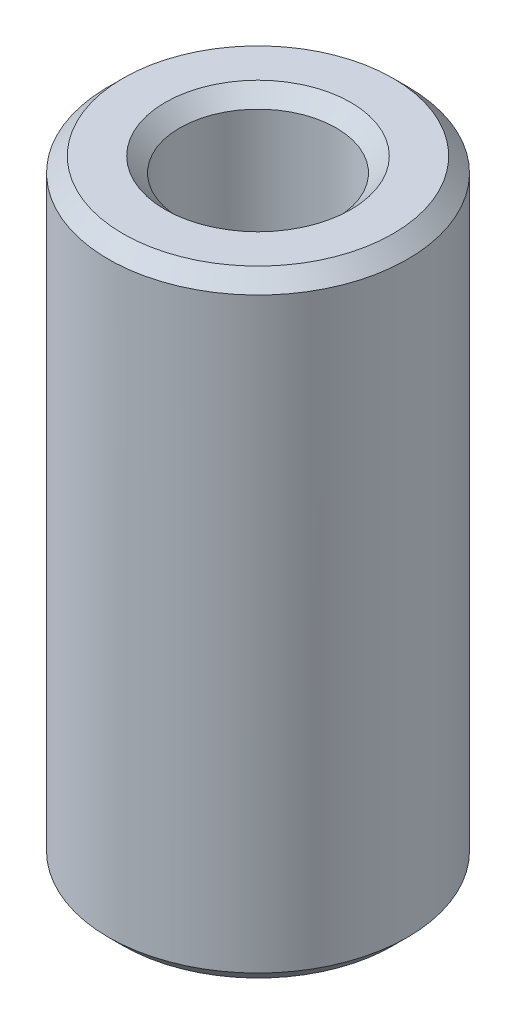
ISO-10303-21;
HEADER;
FILE_DESCRIPTION(('STEP AP214'),'2;1');
FILE_NAME('part.step','',(''),(''),'','','');
FILE_SCHEMA(('AUTOMOTIVE_DESIGN { 1 0 10303 214 1 1 1 1 }'));
ENDSEC;
DATA;
#1=APPLICATION_CONTEXT('core data for automotive mechanical design processes');
#2=APPLICATION_PROTOCOL_DEFINITION('international standard','automotive_design',2000,#1);
#3=PRODUCT_CONTEXT('',#1,'mechanical');
#4=PRODUCT('Part','Part','',(#3));
#5=PRODUCT_RELATED_PRODUCT_CATEGORY('part','',(#4));
#6=PRODUCT_DEFINITION_FORMATION('','',#4);
#7=PRODUCT_DEFINITION_CONTEXT('part definition',#1,'design');
#8=PRODUCT_DEFINITION('design','',#6,#7);
#9=PRODUCT_DEFINITION_SHAPE('','',#8);
#10=(LENGTH_UNIT() NAMED_UNIT(*) SI_UNIT(.MILLI.,.METRE.));
#11=(NAMED_UNIT(*) PLANE_ANGLE_UNIT() SI_UNIT($,.RADIAN.));
#12=(NAMED_UNIT(*) SI_UNIT($,.STERADIAN.) SOLID_ANGLE_UNIT());
#13=UNCERTAINTY_MEASURE_WITH_UNIT(LENGTH_MEASURE(1.E-05),#10,'distance_accuracy_value','');
#14=(GEOMETRIC_REPRESENTATION_CONTEXT(3) GLOBAL_UNCERTAINTY_ASSIGNED_CONTEXT((#13)) GLOBAL_UNIT_ASSIGNED_CONTEXT((#10,
#11,#12)) REPRESENTATION_CONTEXT('',''));
#15=CARTESIAN_POINT('',(0.,0.,0.));
#16=DIRECTION('',(0.,0.,1.));
#17=DIRECTION('',(1.,0.,0.));
#18=AXIS2_PLACEMENT_3D('',#15,#16,#17);
#19=CARTESIAN_POINT('',(0.,113.377159382142,0.));
#20=DIRECTION('',(0.,-1.,0.));
#21=DIRECTION('',(0.,0.,-1.));
#22=AXIS2_PLACEMENT_3D('',#19,#20,#21);
#23=CYLINDRICAL_SURFACE('',#22,27.5);
#24=CARTESIAN_POINT('',(0.,2.7012525845611,0.));
#25=DIRECTION('',(0.,1.,0.));
#26=DIRECTION('',(0.,0.,1.));
#27=AXIS2_PLACEMENT_3D('',#24,#25,#26);
#28=CIRCLE('',#27,27.5);
#29=CARTESIAN_POINT('',(0.,2.7012525845611,-27.5));
#30=VERTEX_POINT('',#29);
#31=EDGE_CURVE('E10',#30,#30,#28,.T.);
#32=CARTESIAN_POINT('',(0.,110.675906797581,0.));
#33=DIRECTION('',(0.,1.,0.));
#34=DIRECTION('',(0.,0.,1.));
#35=AXIS2_PLACEMENT_3D('',#32,#33,#34);
#36=CIRCLE('',#35,27.5);
#37=CARTESIAN_POINT('',(0.,110.675906797581,-27.5));
#38=VERTEX_POINT('',#37);
#39=EDGE_CURVE('E50',#38,#38,#36,.F.);
#40=CARTESIAN_POINT('',(0.,2.7012525845611,-27.5));
#41=CARTESIAN_POINT('',(0.,3.82598856594672,-27.5));
#42=CARTESIAN_POINT('',(0.,4.95072454733234,-27.5));
#43=CARTESIAN_POINT('',(0.,7.20019651010359,-27.5));
#44=CARTESIAN_POINT('',(0.,8.32493249148922,-27.5));
#45=CARTESIAN_POINT('',(0.,10.5744044542605,-27.5));
#46=CARTESIAN_POINT('',(0.,11.6991404356461,-27.5));
#47=CARTESIAN_POINT('',(0.,13.9486123984173,-27.5));
#48=CARTESIAN_POINT('',(0.,15.073348379803,-27.5));
#49=CARTESIAN_POINT('',(0.,17.3228203425742,-27.5));
#50=CARTESIAN_POINT('',(0.,18.4475563239598,-27.5));
#51=CARTESIAN_POINT('',(0.,20.6970282867311,-27.5));
#52=CARTESIAN_POINT('',(0.,21.8217642681167,-27.5));
#53=CARTESIAN_POINT('',(0.,24.071236230888,-27.5));
#54=CARTESIAN_POINT('',(0.,25.1959722122736,-27.5));
#55=CARTESIAN_POINT('',(0.,27.4454441750448,-27.5));
#56=CARTESIAN_POINT('',(0.,28.5701801564305,-27.5));
#57=CARTESIAN_POINT('',(0.,30.8196521192017,-27.5));
#58=CARTESIAN_POINT('',(0.,31.9443881005873,-27.5));
#59=CARTESIAN_POINT('',(0.,34.1938600633586,-27.5));
#60=CARTESIAN_POINT('',(0.,35.3185960447442,-27.5));
#61=CARTESIAN_POINT('',(0.,37.5680680075154,-27.5));
#62=CARTESIAN_POINT('',(0.,38.6928039889011,-27.5));
#63=CARTESIAN_POINT('',(0.,40.9422759516723,-27.5));
#64=CARTESIAN_POINT('',(0.,42.0670119330579,-27.5));
#65=CARTESIAN_POINT('',(0.,44.3164838958292,-27.5));
#66=CARTESIAN_POINT('',(0.,45.4412198772148,-27.5));
#67=CARTESIAN_POINT('',(0.,47.6906918399861,-27.5));
#68=CARTESIAN_POINT('',(0.,48.8154278213717,-27.5));
#69=CARTESIAN_POINT('',(0.,51.0648997841429,-27.5));
#70=CARTESIAN_POINT('',(0.,52.1896357655286,-27.5));
#71=CARTESIAN_POINT('',(0.,54.4391077282998,-27.5));
#72=CARTESIAN_POINT('',(0.,55.5638437096854,-27.5));
#73=CARTESIAN_POINT('',(0.,57.8133156724567,-27.5));
#74=CARTESIAN_POINT('',(0.,58.9380516538423,-27.5));
#75=CARTESIAN_POINT('',(0.,61.1875236166136,-27.5));
#76=CARTESIAN_POINT('',(0.,62.3122595979992,-27.5));
#77=CARTESIAN_POINT('',(0.,64.5617315607704,-27.5));
#78=CARTESIAN_POINT('',(0.,65.6864675421561,-27.5));
#79=CARTESIAN_POINT('',(0.,67.9359395049273,-27.5));
#80=CARTESIAN_POINT('',(0.,69.0606754863129,-27.5));
#81=CARTESIAN_POINT('',(0.,71.3101474490842,-27.5));
#82=CARTESIAN_POINT('',(0.,72.4348834304698,-27.5));
#83=CARTESIAN_POINT('',(0.,74.684355393241,-27.5));
#84=CARTESIAN_POINT('',(0.,75.8090913746267,-27.5));
#85=CARTESIAN_POINT('',(0.,78.0585633373979,-27.5));
#86=CARTESIAN_POINT('',(0.,79.1832993187835,-27.5));
#87=CARTESIAN_POINT('',(0.,81.4327712815548,-27.5));
#88=CARTESIAN_POINT('',(0.,82.5575072629404,-27.5));
#89=CARTESIAN_POINT('',(0.,84.8069792257117,-27.5));
#90=CARTESIAN_POINT('',(0.,85.9317152070973,-27.5));
#91=CARTESIAN_POINT('',(0.,88.1811871698685,-27.5));
#92=CARTESIAN_POINT('',(0.,89.3059231512542,-27.5));
#93=CARTESIAN_POINT('',(0.,91.5553951140254,-27.5));
#94=CARTESIAN_POINT('',(0.,92.680131095411,-27.5));
#95=CARTESIAN_POINT('',(0.,94.9296030581823,-27.5));
#96=CARTESIAN_POINT('',(0.,96.0543390395679,-27.5));
#97=CARTESIAN_POINT('',(0.,98.3038110023391,-27.5));
#98=CARTESIAN_POINT('',(0.,99.4285469837248,-27.5));
#99=CARTESIAN_POINT('',(0.,101.678018946496,-27.5));
#100=CARTESIAN_POINT('',(0.,102.802754927882,-27.5));
#101=CARTESIAN_POINT('',(0.,105.052226890653,-27.5));
#102=CARTESIAN_POINT('',(0.,106.176962872039,-27.5));
#103=CARTESIAN_POINT('',(0.,108.42643483481,-27.5));
#104=CARTESIAN_POINT('',(0.,109.551170816195,-27.5));
#105=CARTESIAN_POINT('',(0.,110.675906797581,-27.5));
#106=B_SPLINE_CURVE_WITH_KNOTS('',3,(#40,#41,#42,#43,#44,#45,#46,#47,#48,#49,#50,#51,#52,#53,
#54,#55,#56,#57,#58,#59,#60,#61,#62,#63,#64,#65,#66,#67,#68,#69,#70,#71,#72,#73,#74,#75,#76,#77,
#78,#79,#80,#81,#82,#83,#84,#85,#86,#87,#88,#89,#90,#91,#92,#93,#94,#95,#96,#97,#98,#99,#100,
#101,#102,#103,#104,#105),.UNSPECIFIED.,.F.,.F.,(4,2,2,2,2,2,2,2,2,2,2,2,2,2,2,2,2,2,2,2,2,2,2,
2,2,2,2,2,2,2,2,2,4),(0.,3.37420794415687,6.74841588831375,10.1226238324706,13.4968317766275,
16.8710397207844,20.2452476649412,23.6194556090981,26.993663553255,30.3678714974119,
33.7420794415687,37.1162873857256,40.4904953298825,43.8647032740393,47.2389112181962,
50.6131191623531,53.98732710651,57.3615350506668,60.7357429948237,64.1099509389806,
67.4841588831375,70.8583668272943,74.2325747714512,77.6067827156081,80.9809906597649,
84.3551986039218,87.7294065480787,91.1036144922356,94.4778224363924,97.8520303805493,
101.226238324706,104.600446268863,107.97465421302),.UNSPECIFIED.);
#107=EDGE_CURVE('BSEAM39',#30,#38,#106,.T.);
#108=ORIENTED_EDGE('',*,*,#31,.T.);
#109=ORIENTED_EDGE('',*,*,#39,.T.);
#110=ORIENTED_EDGE('',*,*,#107,.T.);
#111=ORIENTED_EDGE('',*,*,#107,.F.);
#112=EDGE_LOOP('',(#108,#110,#109,#111));
#113=FACE_BOUND('',#112,.T.);
#114=ADVANCED_FACE('F39',(#113),#23,.T.);
#115=CARTESIAN_POINT('',(0.,113.377159382142,0.));
#116=DIRECTION('',(0.,1.,0.));
#117=DIRECTION('',(0.,0.,1.));
#118=AXIS2_PLACEMENT_3D('',#115,#116,#117);
#119=PLANE('',#118);
#120=CARTESIAN_POINT('',(0.,113.377159382142,0.));
#121=DIRECTION('',(0.,1.,0.));
#122=DIRECTION('',(0.,0.,1.));
#123=AXIS2_PLACEMENT_3D('',#120,#121,#122);
#124=CIRCLE('',#123,17.073561657783);
#125=CARTESIAN_POINT('',(0.,113.377159382142,17.073561657783));
#126=VERTEX_POINT('',#125);
#127=EDGE_CURVE('E58',#126,#126,#124,.F.);
#128=ORIENTED_EDGE('',*,*,#127,.T.);
#129=EDGE_LOOP('',(#128));
#130=FACE_BOUND('',#129,.T.);
#131=CARTESIAN_POINT('',(0.,113.377159382142,0.));
#132=DIRECTION('',(0.,1.,0.));
#133=DIRECTION('',(0.,0.,1.));
#134=AXIS2_PLACEMENT_3D('',#131,#132,#133);
#135=CIRCLE('',#134,24.7987474154391);
#136=CARTESIAN_POINT('',(0.,113.377159382142,24.7987474154391));
#137=VERTEX_POINT('',#136);
#138=EDGE_CURVE('E61',#137,#137,#135,.T.);
#139=ORIENTED_EDGE('',*,*,#138,.T.);
#140=EDGE_LOOP('',(#139));
#141=FACE_BOUND('',#140,.T.);
#142=ADVANCED_FACE('F88',(#130,#141),#119,.T.);
#143=CARTESIAN_POINT('',(0.,0.,0.));
#144=DIRECTION('',(0.,1.,0.));
#145=DIRECTION('',(0.,0.,1.));
#146=AXIS2_PLACEMENT_3D('',#143,#144,#145);
#147=PLANE('',#146);
#148=CARTESIAN_POINT('',(0.,0.,0.));
#149=DIRECTION('',(0.,1.,0.));
#150=DIRECTION('',(0.,0.,1.));
#151=AXIS2_PLACEMENT_3D('',#148,#149,#150);
#152=CIRCLE('',#151,17.0735616577828);
#153=CARTESIAN_POINT('',(0.,0.,17.0735616577828));
#154=VERTEX_POINT('',#153);
#155=EDGE_CURVE('E51',#154,#154,#152,.T.);
#156=ORIENTED_EDGE('',*,*,#155,.T.);
#157=EDGE_LOOP('',(#156));
#158=FACE_BOUND('',#157,.T.);
#159=CARTESIAN_POINT('',(0.,0.,0.));
#160=DIRECTION('',(0.,1.,0.));
#161=DIRECTION('',(0.,0.,1.));
#162=AXIS2_PLACEMENT_3D('',#159,#160,#161);
#163=CIRCLE('',#162,24.7987474154389);
#164=CARTESIAN_POINT('',(0.,0.,24.7987474154389));
#165=VERTEX_POINT('',#164);
#166=EDGE_CURVE('E54',#165,#165,#163,.F.);
#167=ORIENTED_EDGE('',*,*,#166,.T.);
#168=EDGE_LOOP('',(#167));
#169=FACE_BOUND('',#168,.T.);
#170=ADVANCED_FACE('F83',(#158,#169),#147,.F.);
#171=CARTESIAN_POINT('',(0.,113.377159382142,0.));
#172=DIRECTION('',(0.,-1.,0.));
#173=DIRECTION('',(0.,0.,-1.));
#174=AXIS2_PLACEMENT_3D('',#171,#172,#173);
#175=CYLINDRICAL_SURFACE('',#174,14.3723090732219);
#176=CARTESIAN_POINT('',(0.,110.675906797581,0.));
#177=DIRECTION('',(0.,1.,0.));
#178=DIRECTION('',(0.,0.,1.));
#179=AXIS2_PLACEMENT_3D('',#176,#177,#178);
#180=CIRCLE('',#179,14.3723090732219);
#181=CARTESIAN_POINT('',(0.,110.675906797581,-14.3723090732219));
#182=VERTEX_POINT('',#181);
#183=EDGE_CURVE('E67',#182,#182,#180,.T.);
#184=CARTESIAN_POINT('',(0.,2.70125258456096,0.));
#185=DIRECTION('',(0.,1.,0.));
#186=DIRECTION('',(0.,0.,1.));
#187=AXIS2_PLACEMENT_3D('',#184,#185,#186);
#188=CIRCLE('',#187,14.3723090732219);
#189=CARTESIAN_POINT('',(0.,2.70125258456096,-14.3723090732219));
#190=VERTEX_POINT('',#189);
#191=EDGE_CURVE('E69',#190,#190,#188,.F.);
#192=CARTESIAN_POINT('',(0.,110.675906797581,-14.3723090732219));
#193=CARTESIAN_POINT('',(0.,109.551170816195,-14.3723090732219));
#194=CARTESIAN_POINT('',(0.,108.42643483481,-14.3723090732219));
#195=CARTESIAN_POINT('',(0.,106.176962872038,-14.3723090732219));
#196=CARTESIAN_POINT('',(0.,105.052226890653,-14.3723090732219));
#197=CARTESIAN_POINT('',(0.,102.802754927882,-14.3723090732219));
#198=CARTESIAN_POINT('',(0.,101.678018946496,-14.3723090732219));
#199=CARTESIAN_POINT('',(0.,99.4285469837246,-14.3723090732219));
#200=CARTESIAN_POINT('',(0.,98.303811002339,-14.3723090732219));
#201=CARTESIAN_POINT('',(0.,96.0543390395678,-14.3723090732219));
#202=CARTESIAN_POINT('',(0.,94.9296030581822,-14.3723090732219));
#203=CARTESIAN_POINT('',(0.,92.6801310954109,-14.3723090732219));
#204=CARTESIAN_POINT('',(0.,91.5553951140253,-14.3723090732219));
#205=CARTESIAN_POINT('',(0.,89.305923151254,-14.3723090732219));
#206=CARTESIAN_POINT('',(0.,88.1811871698684,-14.3723090732219));
#207=CARTESIAN_POINT('',(0.,85.9317152070972,-14.3723090732219));
#208=CARTESIAN_POINT('',(0.,84.8069792257115,-14.3723090732219));
#209=CARTESIAN_POINT('',(0.,82.5575072629403,-14.3723090732219));
#210=CARTESIAN_POINT('',(0.,81.4327712815547,-14.3723090732219));
#211=CARTESIAN_POINT('',(0.,79.1832993187834,-14.3723090732219));
#212=CARTESIAN_POINT('',(0.,78.0585633373978,-14.3723090732219));
#213=CARTESIAN_POINT('',(0.,75.8090913746265,-14.3723090732219));
#214=CARTESIAN_POINT('',(0.,74.6843553932409,-14.3723090732219));
#215=CARTESIAN_POINT('',(0.,72.4348834304697,-14.3723090732219));
#216=CARTESIAN_POINT('',(0.,71.310147449084,-14.3723090732219));
#217=CARTESIAN_POINT('',(0.,69.0606754863128,-14.3723090732219));
#218=CARTESIAN_POINT('',(0.,67.9359395049272,-14.3723090732219));
#219=CARTESIAN_POINT('',(0.,65.6864675421559,-14.3723090732219));
#220=CARTESIAN_POINT('',(0.,64.5617315607703,-14.3723090732219));
#221=CARTESIAN_POINT('',(0.,62.312259597999,-14.3723090732219));
#222=CARTESIAN_POINT('',(0.,61.1875236166134,-14.3723090732219));
#223=CARTESIAN_POINT('',(0.,58.9380516538422,-14.3723090732219));
#224=CARTESIAN_POINT('',(0.,57.8133156724566,-14.3723090732219));
#225=CARTESIAN_POINT('',(0.,55.5638437096853,-14.3723090732219));
#226=CARTESIAN_POINT('',(0.,54.4391077282997,-14.3723090732219));
#227=CARTESIAN_POINT('',(0.,52.1896357655284,-14.3723090732219));
#228=CARTESIAN_POINT('',(0.,51.0648997841428,-14.3723090732219));
#229=CARTESIAN_POINT('',(0.,48.8154278213716,-14.3723090732219));
#230=CARTESIAN_POINT('',(0.,47.6906918399859,-14.3723090732219));
#231=CARTESIAN_POINT('',(0.,45.4412198772147,-14.3723090732219));
#232=CARTESIAN_POINT('',(0.,44.3164838958291,-14.3723090732219));
#233=CARTESIAN_POINT('',(0.,42.0670119330578,-14.3723090732219));
#234=CARTESIAN_POINT('',(0.,40.9422759516722,-14.3723090732219));
#235=CARTESIAN_POINT('',(0.,38.6928039889009,-14.3723090732219));
#236=CARTESIAN_POINT('',(0.,37.5680680075153,-14.3723090732219));
#237=CARTESIAN_POINT('',(0.,35.3185960447441,-14.3723090732219));
#238=CARTESIAN_POINT('',(0.,34.1938600633584,-14.3723090732219));
#239=CARTESIAN_POINT('',(0.,31.9443881005872,-14.3723090732219));
#240=CARTESIAN_POINT('',(0.,30.8196521192016,-14.3723090732219));
#241=CARTESIAN_POINT('',(0.,28.5701801564303,-14.3723090732219));
#242=CARTESIAN_POINT('',(0.,27.4454441750447,-14.3723090732219));
#243=CARTESIAN_POINT('',(0.,25.1959722122734,-14.3723090732219));
#244=CARTESIAN_POINT('',(0.,24.0712362308878,-14.3723090732219));
#245=CARTESIAN_POINT('',(0.,21.8217642681166,-14.3723090732219));
#246=CARTESIAN_POINT('',(0.,20.697028286731,-14.3723090732219));
#247=CARTESIAN_POINT('',(0.,18.4475563239597,-14.3723090732219));
#248=CARTESIAN_POINT('',(0.,17.3228203425741,-14.3723090732219));
#249=CARTESIAN_POINT('',(0.,15.0733483798028,-14.3723090732219));
#250=CARTESIAN_POINT('',(0.,13.9486123984172,-14.3723090732219));
#251=CARTESIAN_POINT('',(0.,11.699140435646,-14.3723090732219));
#252=CARTESIAN_POINT('',(0.,10.5744044542603,-14.3723090732219));
#253=CARTESIAN_POINT('',(0.,8.32493249148909,-14.3723090732219));
#254=CARTESIAN_POINT('',(0.,7.20019651010346,-14.3723090732219));
#255=CARTESIAN_POINT('',(0.,4.95072454733221,-14.3723090732219));
#256=CARTESIAN_POINT('',(0.,3.82598856594659,-14.3723090732219));
#257=CARTESIAN_POINT('',(0.,2.70125258456096,-14.3723090732219));
#258=B_SPLINE_CURVE_WITH_KNOTS('',3,(#192,#193,#194,#195,#196,#197,#198,#199,#200,#201,#202,
#203,#204,#205,#206,#207,#208,#209,#210,#211,#212,#213,#214,#215,#216,#217,#218,#219,#220,#221,
#222,#223,#224,#225,#226,#227,#228,#229,#230,#231,#232,#233,#234,#235,#236,#237,#238,#239,#240,
#241,#242,#243,#244,#245,#246,#247,#248,#249,#250,#251,#252,#253,#254,#255,#256,#257),
.UNSPECIFIED.,.F.,.F.,(4,2,2,2,2,2,2,2,2,2,2,2,2,2,2,2,2,2,2,2,2,2,2,2,2,2,2,2,2,2,2,2,4),(0.,
3.37420794415688,6.74841588831375,10.1226238324706,13.4968317766275,16.8710397207844,
20.2452476649412,23.6194556090981,26.993663553255,30.3678714974119,33.7420794415687,
37.1162873857256,40.4904953298825,43.8647032740393,47.2389112181962,50.6131191623531,
53.98732710651,57.3615350506668,60.7357429948237,64.1099509389806,67.4841588831375,
70.8583668272943,74.2325747714512,77.6067827156081,80.9809906597649,84.3551986039218,
87.7294065480787,91.1036144922356,94.4778224363924,97.8520303805493,101.226238324706,
104.600446268863,107.97465421302),.UNSPECIFIED.);
#259=EDGE_CURVE('BSEAM71',#182,#190,#258,.T.);
#260=ORIENTED_EDGE('',*,*,#183,.T.);
#261=ORIENTED_EDGE('',*,*,#191,.T.);
#262=ORIENTED_EDGE('',*,*,#259,.T.);
#263=ORIENTED_EDGE('',*,*,#259,.F.);
#264=EDGE_LOOP('',(#260,#262,#261,#263));
#265=FACE_BOUND('',#264,.T.);
#266=ADVANCED_FACE('F71',(#265),#175,.F.);
#267=CARTESIAN_POINT('',(0.,110.675906797581,0.));
#268=DIRECTION('',(0.,1.,0.));
#269=DIRECTION('',(0.,0.,1.));
#270=AXIS2_PLACEMENT_3D('',#267,#268,#269);
#271=CONICAL_SURFACE('',#270,14.3723090732219,0.785398163397454);
#272=ORIENTED_EDGE('',*,*,#127,.F.);
#273=EDGE_LOOP('',(#272));
#274=FACE_BOUND('',#273,.T.);
#275=ORIENTED_EDGE('',*,*,#183,.F.);
#276=EDGE_LOOP('',(#275));
#277=FACE_BOUND('',#276,.T.);
#278=ADVANCED_FACE('F77',(#274,#277),#271,.F.);
#279=CARTESIAN_POINT('',(0.,0.,0.));
#280=DIRECTION('',(0.,-1.,0.));
#281=DIRECTION('',(0.,0.,-1.));
#282=AXIS2_PLACEMENT_3D('',#279,#280,#281);
#283=CONICAL_SURFACE('',#282,17.0735616577828,0.785398163397446);
#284=ORIENTED_EDGE('',*,*,#191,.F.);
#285=EDGE_LOOP('',(#284));
#286=FACE_BOUND('',#285,.T.);
#287=ORIENTED_EDGE('',*,*,#155,.F.);
#288=EDGE_LOOP('',(#287));
#289=FACE_BOUND('',#288,.T.);
#290=ADVANCED_FACE('F73',(#286,#289),#283,.F.);
#291=CARTESIAN_POINT('',(0.,2.7012525845611,0.));
#292=DIRECTION('',(0.,1.,0.));
#293=DIRECTION('',(0.,0.,1.));
#294=AXIS2_PLACEMENT_3D('',#291,#292,#293);
#295=CONICAL_SURFACE('',#294,27.5,0.785398163397452);
#296=ORIENTED_EDGE('',*,*,#166,.F.);
#297=EDGE_LOOP('',(#296));
#298=FACE_BOUND('',#297,.T.);
#299=ORIENTED_EDGE('',*,*,#31,.F.);
#300=EDGE_LOOP('',(#299));
#301=FACE_BOUND('',#300,.T.);
#302=ADVANCED_FACE('F76',(#298,#301),#295,.T.);
#303=CARTESIAN_POINT('',(0.,113.377159382142,0.));
#304=DIRECTION('',(0.,-1.,0.));
#305=DIRECTION('',(0.,0.,-1.));
#306=AXIS2_PLACEMENT_3D('',#303,#304,#305);
#307=CONICAL_SURFACE('',#306,24.7987474154391,0.785398163397445);
#308=ORIENTED_EDGE('',*,*,#39,.F.);
#309=EDGE_LOOP('',(#308));
#310=FACE_BOUND('',#309,.T.);
#311=ORIENTED_EDGE('',*,*,#138,.F.);
#312=EDGE_LOOP('',(#311));
#313=FACE_BOUND('',#312,.T.);
#314=ADVANCED_FACE('F45',(#310,#313),#307,.T.);
#315=CLOSED_SHELL('',(#114,#142,#170,#266,#278,#290,#302,#314));
#316=MANIFOLD_SOLID_BREP('B2',#315);
#317=ADVANCED_BREP_SHAPE_REPRESENTATION('',(#18,#316),#14);
#318=SHAPE_DEFINITION_REPRESENTATION(#9,#317);
ENDSEC;
END-ISO-10303-21;
